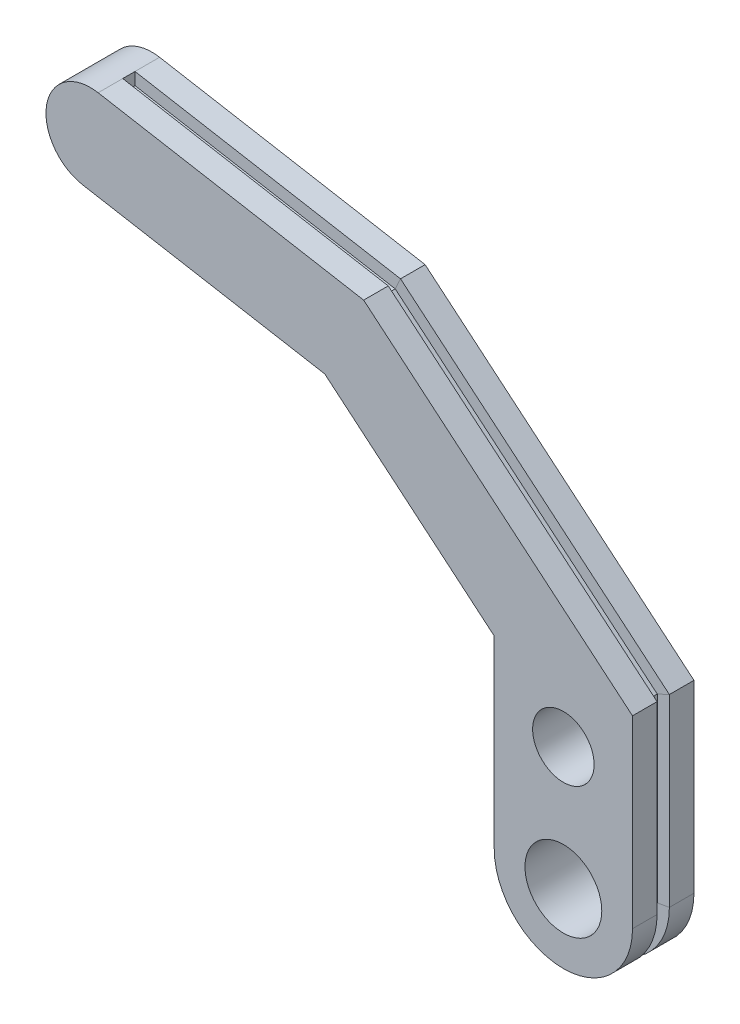
ISO-10303-21;
HEADER;
FILE_DESCRIPTION(('STEP AP214'),'2;1');
FILE_NAME('part.step','',(''),(''),'','','');
FILE_SCHEMA(('AUTOMOTIVE_DESIGN { 1 0 10303 214 1 1 1 1 }'));
ENDSEC;
DATA;
#1=APPLICATION_CONTEXT('core data for automotive mechanical design processes');
#2=APPLICATION_PROTOCOL_DEFINITION('international standard','automotive_design',2000,#1);
#3=PRODUCT_CONTEXT('',#1,'mechanical');
#4=PRODUCT('Part','Part','',(#3));
#5=PRODUCT_RELATED_PRODUCT_CATEGORY('part','',(#4));
#6=PRODUCT_DEFINITION_FORMATION('','',#4);
#7=PRODUCT_DEFINITION_CONTEXT('part definition',#1,'design');
#8=PRODUCT_DEFINITION('design','',#6,#7);
#9=PRODUCT_DEFINITION_SHAPE('','',#8);
#10=(LENGTH_UNIT() NAMED_UNIT(*) SI_UNIT(.MILLI.,.METRE.));
#11=(NAMED_UNIT(*) PLANE_ANGLE_UNIT() SI_UNIT($,.RADIAN.));
#12=(NAMED_UNIT(*) SI_UNIT($,.STERADIAN.) SOLID_ANGLE_UNIT());
#13=UNCERTAINTY_MEASURE_WITH_UNIT(LENGTH_MEASURE(1.E-05),#10,'distance_accuracy_value','');
#14=(GEOMETRIC_REPRESENTATION_CONTEXT(3) GLOBAL_UNCERTAINTY_ASSIGNED_CONTEXT((#13)) GLOBAL_UNIT_ASSIGNED_CONTEXT((#10,
#11,#12)) REPRESENTATION_CONTEXT('',''));
#15=CARTESIAN_POINT('',(0.,0.,0.));
#16=DIRECTION('',(0.,0.,1.));
#17=DIRECTION('',(1.,0.,0.));
#18=AXIS2_PLACEMENT_3D('',#15,#16,#17);
#19=CARTESIAN_POINT('',(0.,0.,6.35));
#20=DIRECTION('',(0.,0.,-1.));
#21=DIRECTION('',(-1.,0.,0.));
#22=AXIS2_PLACEMENT_3D('',#19,#20,#21);
#23=CYLINDRICAL_SURFACE('',#22,7.14375);
#24=CARTESIAN_POINT('',(0.,0.,3.81));
#25=DIRECTION('',(0.,0.,1.));
#26=DIRECTION('',(-1.,0.,0.));
#27=AXIS2_PLACEMENT_3D('',#24,#25,#26);
#28=CIRCLE('',#27,7.14375);
#29=CARTESIAN_POINT('',(-7.14375,0.,3.81));
#30=VERTEX_POINT('',#29);
#31=CARTESIAN_POINT('',(7.14375,0.,3.81));
#32=VERTEX_POINT('',#31);
#33=EDGE_CURVE('E56',#30,#32,#28,.T.);
#34=ORIENTED_EDGE('',*,*,#33,.T.);
#35=DIRECTION('',(0.,0.,-1.));
#36=VECTOR('',#35,1.);
#37=CARTESIAN_POINT('',(7.14375,0.,6.35));
#38=LINE('',#37,#36);
#39=CARTESIAN_POINT('',(7.14375,0.,6.35));
#40=VERTEX_POINT('',#39);
#41=EDGE_CURVE('E11',#40,#32,#38,.T.);
#42=ORIENTED_EDGE('',*,*,#41,.F.);
#43=CARTESIAN_POINT('',(0.,0.,6.35));
#44=DIRECTION('',(0.,0.,1.));
#45=DIRECTION('',(-1.,0.,0.));
#46=AXIS2_PLACEMENT_3D('',#43,#44,#45);
#47=CIRCLE('',#46,7.14375);
#48=CARTESIAN_POINT('',(-7.14375,0.,6.35));
#49=VERTEX_POINT('',#48);
#50=EDGE_CURVE('E183',#49,#40,#47,.T.);
#51=ORIENTED_EDGE('',*,*,#50,.F.);
#52=DIRECTION('',(0.,0.,-1.));
#53=VECTOR('',#52,1.);
#54=CARTESIAN_POINT('',(-7.14375,0.,6.35));
#55=LINE('',#54,#53);
#56=EDGE_CURVE('E184',#49,#30,#55,.T.);
#57=ORIENTED_EDGE('',*,*,#56,.T.);
#58=EDGE_LOOP('',(#34,#42,#51,#57));
#59=FACE_BOUND('',#58,.T.);
#60=ADVANCED_FACE('F41',(#59),#23,.T.);
#61=CARTESIAN_POINT('',(0.,0.,2.54));
#62=DIRECTION('',(0.,0.,1.));
#63=DIRECTION('',(-1.,0.,0.));
#64=AXIS2_PLACEMENT_3D('',#61,#62,#63);
#65=CIRCLE('',#64,7.14375);
#66=CARTESIAN_POINT('',(-7.14375,0.,2.54));
#67=VERTEX_POINT('',#66);
#68=CARTESIAN_POINT('',(7.14375,0.,2.54));
#69=VERTEX_POINT('',#68);
#70=EDGE_CURVE('E347',#67,#69,#65,.T.);
#71=ORIENTED_EDGE('',*,*,#70,.F.);
#72=CARTESIAN_POINT('',(-7.14375,0.,0.));
#73=VERTEX_POINT('',#72);
#74=EDGE_CURVE('E99',#67,#73,#55,.T.);
#75=ORIENTED_EDGE('',*,*,#74,.T.);
#76=CARTESIAN_POINT('',(0.,0.,0.));
#77=DIRECTION('',(0.,0.,1.));
#78=DIRECTION('',(-1.,0.,0.));
#79=AXIS2_PLACEMENT_3D('',#76,#77,#78);
#80=CIRCLE('',#79,7.14375);
#81=CARTESIAN_POINT('',(7.14375,0.,0.));
#82=VERTEX_POINT('',#81);
#83=EDGE_CURVE('E156',#73,#82,#80,.T.);
#84=ORIENTED_EDGE('',*,*,#83,.T.);
#85=EDGE_CURVE('E49',#69,#82,#38,.T.);
#86=ORIENTED_EDGE('',*,*,#85,.F.);
#87=EDGE_LOOP('',(#71,#75,#84,#86));
#88=FACE_BOUND('',#87,.T.);
#89=ADVANCED_FACE('F484',(#88),#23,.T.);
#90=CARTESIAN_POINT('',(7.14375,19.05,6.35));
#91=DIRECTION('',(-1.,0.,0.));
#92=DIRECTION('',(0.,-1.,0.));
#93=AXIS2_PLACEMENT_3D('',#90,#91,#92);
#94=PLANE('',#93);
#95=DIRECTION('',(0.,1.,0.));
#96=VECTOR('',#95,1.);
#97=CARTESIAN_POINT('',(7.14375,0.,3.81));
#98=LINE('',#97,#96);
#99=CARTESIAN_POINT('',(7.14375,19.05,3.81));
#100=VERTEX_POINT('',#99);
#101=EDGE_CURVE('E351',#32,#100,#98,.T.);
#102=ORIENTED_EDGE('',*,*,#101,.T.);
#103=DIRECTION('',(0.,0.,-1.));
#104=VECTOR('',#103,1.);
#105=CARTESIAN_POINT('',(7.14375,19.05,6.35));
#106=LINE('',#105,#104);
#107=CARTESIAN_POINT('',(7.14375,19.05,6.35));
#108=VERTEX_POINT('',#107);
#109=EDGE_CURVE('E202',#108,#100,#106,.T.);
#110=ORIENTED_EDGE('',*,*,#109,.F.);
#111=DIRECTION('',(0.,1.,0.));
#112=VECTOR('',#111,1.);
#113=CARTESIAN_POINT('',(7.14375,19.05,6.35));
#114=LINE('',#113,#112);
#115=EDGE_CURVE('E107',#40,#108,#114,.T.);
#116=ORIENTED_EDGE('',*,*,#115,.F.);
#117=ORIENTED_EDGE('',*,*,#41,.T.);
#118=EDGE_LOOP('',(#102,#110,#116,#117));
#119=FACE_BOUND('',#118,.T.);
#120=ADVANCED_FACE('F439',(#119),#94,.F.);
#121=DIRECTION('',(0.,1.,0.));
#122=VECTOR('',#121,1.);
#123=CARTESIAN_POINT('',(7.14375,0.,2.54));
#124=LINE('',#123,#122);
#125=CARTESIAN_POINT('',(7.14375,19.05,2.54));
#126=VERTEX_POINT('',#125);
#127=EDGE_CURVE('E363',#69,#126,#124,.T.);
#128=ORIENTED_EDGE('',*,*,#127,.F.);
#129=ORIENTED_EDGE('',*,*,#85,.T.);
#130=DIRECTION('',(0.,1.,0.));
#131=VECTOR('',#130,1.);
#132=CARTESIAN_POINT('',(7.14375,19.05,0.));
#133=LINE('',#132,#131);
#134=CARTESIAN_POINT('',(7.14375,19.05,0.));
#135=VERTEX_POINT('',#134);
#136=EDGE_CURVE('E159',#82,#135,#133,.T.);
#137=ORIENTED_EDGE('',*,*,#136,.T.);
#138=EDGE_CURVE('E201',#126,#135,#106,.T.);
#139=ORIENTED_EDGE('',*,*,#138,.F.);
#140=EDGE_LOOP('',(#128,#129,#137,#139));
#141=FACE_BOUND('',#140,.T.);
#142=ADVANCED_FACE('F224',(#141),#94,.F.);
#143=CARTESIAN_POINT('',(7.14375,19.05,6.35));
#144=DIRECTION('',(-0.642787609686537,-0.76604444311898,0.));
#145=DIRECTION('',(0.76604444311898,-0.642787609686537,0.));
#146=AXIS2_PLACEMENT_3D('',#143,#144,#145);
#147=PLANE('',#146);
#148=DIRECTION('',(-0.76604444311898,0.642787609686537,0.));
#149=VECTOR('',#148,1.);
#150=CARTESIAN_POINT('',(7.14375000000001,19.05,3.81));
#151=LINE('',#150,#149);
#152=CARTESIAN_POINT('',(-20.6373567597995,42.3611164358442,3.81));
#153=VERTEX_POINT('',#152);
#154=EDGE_CURVE('E387',#100,#153,#151,.T.);
#155=ORIENTED_EDGE('',*,*,#154,.T.);
#156=DIRECTION('',(0.,0.,-1.));
#157=VECTOR('',#156,1.);
#158=CARTESIAN_POINT('',(-20.6373567597995,42.3611164358442,6.35));
#159=LINE('',#158,#157);
#160=CARTESIAN_POINT('',(-20.6373567597995,42.3611164358442,6.35));
#161=VERTEX_POINT('',#160);
#162=EDGE_CURVE('E198',#161,#153,#159,.T.);
#163=ORIENTED_EDGE('',*,*,#162,.F.);
#164=DIRECTION('',(-0.76604444311898,0.642787609686537,0.));
#165=VECTOR('',#164,1.);
#166=CARTESIAN_POINT('',(7.14375,19.05,6.35));
#167=LINE('',#166,#165);
#168=EDGE_CURVE('E305',#108,#161,#167,.T.);
#169=ORIENTED_EDGE('',*,*,#168,.F.);
#170=ORIENTED_EDGE('',*,*,#109,.T.);
#171=EDGE_LOOP('',(#155,#163,#169,#170));
#172=FACE_BOUND('',#171,.T.);
#173=ADVANCED_FACE('F468',(#172),#147,.F.);
#174=DIRECTION('',(-0.76604444311898,0.642787609686537,0.));
#175=VECTOR('',#174,1.);
#176=CARTESIAN_POINT('',(7.14375000000001,19.05,2.54));
#177=LINE('',#176,#175);
#178=CARTESIAN_POINT('',(-20.6373567597995,42.3611164358442,2.54));
#179=VERTEX_POINT('',#178);
#180=EDGE_CURVE('E220',#126,#179,#177,.T.);
#181=ORIENTED_EDGE('',*,*,#180,.F.);
#182=ORIENTED_EDGE('',*,*,#138,.T.);
#183=DIRECTION('',(-0.76604444311898,0.642787609686537,0.));
#184=VECTOR('',#183,1.);
#185=CARTESIAN_POINT('',(7.14375,19.05,0.));
#186=LINE('',#185,#184);
#187=CARTESIAN_POINT('',(-20.6373567597995,42.3611164358442,0.));
#188=VERTEX_POINT('',#187);
#189=EDGE_CURVE('E164',#135,#188,#186,.T.);
#190=ORIENTED_EDGE('',*,*,#189,.T.);
#191=EDGE_CURVE('E197',#179,#188,#159,.T.);
#192=ORIENTED_EDGE('',*,*,#191,.F.);
#193=EDGE_LOOP('',(#181,#182,#190,#192));
#194=FACE_BOUND('',#193,.T.);
#195=ADVANCED_FACE('F214',(#194),#147,.F.);
#196=CARTESIAN_POINT('',(-20.6373567597995,42.3611164358442,6.35));
#197=DIRECTION('',(-0.173648177666924,-0.984807753012209,0.));
#198=DIRECTION('',(0.984807753012209,-0.173648177666924,0.));
#199=AXIS2_PLACEMENT_3D('',#196,#197,#198);
#200=PLANE('',#199);
#201=DIRECTION('',(-0.984807753012209,0.173648177666924,0.));
#202=VECTOR('',#201,1.);
#203=CARTESIAN_POINT('',(-20.6373567597995,42.3611164358442,3.81));
#204=LINE('',#203,#202);
#205=CARTESIAN_POINT('',(-48.0748879046232,47.1990934607053,3.81));
#206=VERTEX_POINT('',#205);
#207=EDGE_CURVE('E271',#153,#206,#204,.T.);
#208=ORIENTED_EDGE('',*,*,#207,.T.);
#209=DIRECTION('',(0.,0.,-1.));
#210=VECTOR('',#209,1.);
#211=CARTESIAN_POINT('',(-48.0748879046232,47.1990934607053,6.35));
#212=LINE('',#211,#210);
#213=CARTESIAN_POINT('',(-48.0748879046232,47.1990934607053,6.35));
#214=VERTEX_POINT('',#213);
#215=EDGE_CURVE('E193',#214,#206,#212,.T.);
#216=ORIENTED_EDGE('',*,*,#215,.F.);
#217=DIRECTION('',(-0.984807753012209,0.173648177666924,0.));
#218=VECTOR('',#217,1.);
#219=CARTESIAN_POINT('',(-20.6373567597995,42.3611164358442,6.35));
#220=LINE('',#219,#218);
#221=EDGE_CURVE('E308',#161,#214,#220,.T.);
#222=ORIENTED_EDGE('',*,*,#221,.F.);
#223=ORIENTED_EDGE('',*,*,#162,.T.);
#224=EDGE_LOOP('',(#208,#216,#222,#223));
#225=FACE_BOUND('',#224,.T.);
#226=ADVANCED_FACE('F471',(#225),#200,.F.);
#227=DIRECTION('',(-0.984807753012209,0.173648177666924,0.));
#228=VECTOR('',#227,1.);
#229=CARTESIAN_POINT('',(-20.6373567597995,42.3611164358442,2.54));
#230=LINE('',#229,#228);
#231=CARTESIAN_POINT('',(-48.0748879046232,47.1990934607053,2.54));
#232=VERTEX_POINT('',#231);
#233=EDGE_CURVE('E239',#179,#232,#230,.T.);
#234=ORIENTED_EDGE('',*,*,#233,.F.);
#235=ORIENTED_EDGE('',*,*,#191,.T.);
#236=DIRECTION('',(-0.984807753012209,0.173648177666924,0.));
#237=VECTOR('',#236,1.);
#238=CARTESIAN_POINT('',(-20.6373567597995,42.3611164358442,0.));
#239=LINE('',#238,#237);
#240=CARTESIAN_POINT('',(-48.0748879046232,47.1990934607053,0.));
#241=VERTEX_POINT('',#240);
#242=EDGE_CURVE('E168',#188,#241,#239,.T.);
#243=ORIENTED_EDGE('',*,*,#242,.T.);
#244=EDGE_CURVE('E192',#232,#241,#212,.T.);
#245=ORIENTED_EDGE('',*,*,#244,.F.);
#246=EDGE_LOOP('',(#234,#235,#243,#245));
#247=FACE_BOUND('',#246,.T.);
#248=ADVANCED_FACE('F234',(#247),#200,.F.);
#249=CARTESIAN_POINT('',(0.,0.,6.35));
#250=DIRECTION('',(0.,0.,-1.));
#251=DIRECTION('',(-1.,0.,0.));
#252=AXIS2_PLACEMENT_3D('',#249,#250,#251);
#253=PLANE('',#252);
#254=ORIENTED_EDGE('',*,*,#50,.T.);
#255=ORIENTED_EDGE('',*,*,#115,.T.);
#256=ORIENTED_EDGE('',*,*,#168,.T.);
#257=ORIENTED_EDGE('',*,*,#221,.T.);
#258=CARTESIAN_POINT('',(-48.8722654004166,42.6769409654397,6.35));
#259=DIRECTION('',(0.,0.,1.));
#260=DIRECTION('',(1.,0.,0.));
#261=AXIS2_PLACEMENT_3D('',#258,#259,#260);
#262=CIRCLE('',#261,4.5919139866982);
#263=CARTESIAN_POINT('',(-49.66964289621,38.1547884701741,6.35));
#264=VERTEX_POINT('',#263);
#265=EDGE_CURVE('E131',#214,#264,#262,.T.);
#266=ORIENTED_EDGE('',*,*,#265,.T.);
#267=DIRECTION('',(0.984807753012209,-0.173648177666924,0.));
#268=VECTOR('',#267,1.);
#269=CARTESIAN_POINT('',(-24.6555259696999,33.7441247574342,6.35));
#270=LINE('',#269,#268);
#271=CARTESIAN_POINT('',(-24.6555259696999,33.7441247574342,6.35));
#272=VERTEX_POINT('',#271);
#273=EDGE_CURVE('E123',#264,#272,#270,.T.);
#274=ORIENTED_EDGE('',*,*,#273,.T.);
#275=DIRECTION('',(0.76604444311898,-0.642787609686537,0.));
#276=VECTOR('',#275,1.);
#277=CARTESIAN_POINT('',(-7.14375,19.05,6.35));
#278=LINE('',#277,#276);
#279=CARTESIAN_POINT('',(-7.14375,19.05,6.35));
#280=VERTEX_POINT('',#279);
#281=EDGE_CURVE('E128',#272,#280,#278,.T.);
#282=ORIENTED_EDGE('',*,*,#281,.T.);
#283=DIRECTION('',(0.,-1.,0.));
#284=VECTOR('',#283,1.);
#285=CARTESIAN_POINT('',(-7.14375,0.,6.35));
#286=LINE('',#285,#284);
#287=EDGE_CURVE('E65',#280,#49,#286,.T.);
#288=ORIENTED_EDGE('',*,*,#287,.T.);
#289=EDGE_LOOP('',(#254,#255,#256,#257,#266,#274,#282,#288));
#290=FACE_BOUND('',#289,.T.);
#291=CARTESIAN_POINT('',(0.,0.,6.35));
#292=DIRECTION('',(0.,0.,1.));
#293=DIRECTION('',(1.,0.,0.));
#294=AXIS2_PLACEMENT_3D('',#291,#292,#293);
#295=CIRCLE('',#294,3.96875);
#296=CARTESIAN_POINT('',(3.96875,0.,6.35));
#297=VERTEX_POINT('',#296);
#298=EDGE_CURVE('E160',#297,#297,#295,.T.);
#299=ORIENTED_EDGE('',*,*,#298,.F.);
#300=EDGE_LOOP('',(#299));
#301=FACE_BOUND('',#300,.T.);
#302=CARTESIAN_POINT('',(0.,12.7,6.35));
#303=DIRECTION('',(0.,0.,1.));
#304=DIRECTION('',(1.,0.,0.));
#305=AXIS2_PLACEMENT_3D('',#302,#303,#304);
#306=CIRCLE('',#305,3.175);
#307=CARTESIAN_POINT('',(3.175,12.7,6.35));
#308=VERTEX_POINT('',#307);
#309=EDGE_CURVE('E285',#308,#308,#306,.T.);
#310=ORIENTED_EDGE('',*,*,#309,.F.);
#311=EDGE_LOOP('',(#310));
#312=FACE_BOUND('',#311,.T.);
#313=ADVANCED_FACE('F125',(#290,#301,#312),#253,.F.);
#314=CARTESIAN_POINT('',(0.,0.,0.));
#315=DIRECTION('',(0.,0.,-1.));
#316=DIRECTION('',(-1.,0.,0.));
#317=AXIS2_PLACEMENT_3D('',#314,#315,#316);
#318=PLANE('',#317);
#319=CARTESIAN_POINT('',(0.,0.,0.));
#320=DIRECTION('',(0.,0.,1.));
#321=DIRECTION('',(1.,0.,0.));
#322=AXIS2_PLACEMENT_3D('',#319,#320,#321);
#323=CIRCLE('',#322,3.96875);
#324=CARTESIAN_POINT('',(3.96875,0.,0.));
#325=VERTEX_POINT('',#324);
#326=EDGE_CURVE('E289',#325,#325,#323,.T.);
#327=ORIENTED_EDGE('',*,*,#326,.T.);
#328=EDGE_LOOP('',(#327));
#329=FACE_BOUND('',#328,.T.);
#330=ORIENTED_EDGE('',*,*,#83,.F.);
#331=DIRECTION('',(0.,-1.,0.));
#332=VECTOR('',#331,1.);
#333=CARTESIAN_POINT('',(-7.14375,0.,0.));
#334=LINE('',#333,#332);
#335=CARTESIAN_POINT('',(-7.14375,19.05,0.));
#336=VERTEX_POINT('',#335);
#337=EDGE_CURVE('E180',#336,#73,#334,.T.);
#338=ORIENTED_EDGE('',*,*,#337,.F.);
#339=DIRECTION('',(0.76604444311898,-0.642787609686537,0.));
#340=VECTOR('',#339,1.);
#341=CARTESIAN_POINT('',(-7.14375,19.05,0.));
#342=LINE('',#341,#340);
#343=CARTESIAN_POINT('',(-24.6555259696999,33.7441247574342,0.));
#344=VERTEX_POINT('',#343);
#345=EDGE_CURVE('E177',#344,#336,#342,.T.);
#346=ORIENTED_EDGE('',*,*,#345,.F.);
#347=DIRECTION('',(0.984807753012209,-0.173648177666924,0.));
#348=VECTOR('',#347,1.);
#349=CARTESIAN_POINT('',(-24.6555259696999,33.7441247574342,0.));
#350=LINE('',#349,#348);
#351=CARTESIAN_POINT('',(-49.66964289621,38.1547884701741,0.));
#352=VERTEX_POINT('',#351);
#353=EDGE_CURVE('E141',#352,#344,#350,.T.);
#354=ORIENTED_EDGE('',*,*,#353,.F.);
#355=CARTESIAN_POINT('',(-48.8722654004166,42.6769409654397,0.));
#356=DIRECTION('',(0.,0.,1.));
#357=DIRECTION('',(1.,0.,0.));
#358=AXIS2_PLACEMENT_3D('',#355,#356,#357);
#359=CIRCLE('',#358,4.5919139866982);
#360=EDGE_CURVE('E172',#241,#352,#359,.T.);
#361=ORIENTED_EDGE('',*,*,#360,.F.);
#362=ORIENTED_EDGE('',*,*,#242,.F.);
#363=ORIENTED_EDGE('',*,*,#189,.F.);
#364=ORIENTED_EDGE('',*,*,#136,.F.);
#365=EDGE_LOOP('',(#330,#338,#346,#354,#361,#362,#363,#364));
#366=FACE_BOUND('',#365,.T.);
#367=CARTESIAN_POINT('',(0.,12.7,0.));
#368=DIRECTION('',(0.,0.,1.));
#369=DIRECTION('',(1.,0.,0.));
#370=AXIS2_PLACEMENT_3D('',#367,#368,#369);
#371=CIRCLE('',#370,3.175);
#372=CARTESIAN_POINT('',(3.175,12.7,0.));
#373=VERTEX_POINT('',#372);
#374=EDGE_CURVE('E290',#373,#373,#371,.T.);
#375=ORIENTED_EDGE('',*,*,#374,.T.);
#376=EDGE_LOOP('',(#375));
#377=FACE_BOUND('',#376,.T.);
#378=ADVANCED_FACE('F228',(#329,#366,#377),#318,.T.);
#379=CARTESIAN_POINT('',(-48.8722654004166,42.6769409654397,6.35));
#380=DIRECTION('',(0.,0.,-1.));
#381=DIRECTION('',(-1.,0.,0.));
#382=AXIS2_PLACEMENT_3D('',#379,#380,#381);
#383=CYLINDRICAL_SURFACE('',#382,4.5919139866982);
#384=ORIENTED_EDGE('',*,*,#360,.T.);
#385=DIRECTION('',(0.,0.,-1.));
#386=VECTOR('',#385,1.);
#387=CARTESIAN_POINT('',(-49.66964289621,38.1547884701741,6.35));
#388=LINE('',#387,#386);
#389=EDGE_CURVE('E145',#264,#352,#388,.T.);
#390=ORIENTED_EDGE('',*,*,#389,.F.);
#391=ORIENTED_EDGE('',*,*,#265,.F.);
#392=ORIENTED_EDGE('',*,*,#215,.T.);
#393=DIRECTION('',(0.,0.,1.));
#394=VECTOR('',#393,1.);
#395=CARTESIAN_POINT('',(-48.0748879046232,47.1990934607053,3.81));
#396=LINE('',#395,#394);
#397=EDGE_CURVE('E246',#232,#206,#396,.T.);
#398=ORIENTED_EDGE('',*,*,#397,.F.);
#399=ORIENTED_EDGE('',*,*,#244,.T.);
#400=EDGE_LOOP('',(#384,#390,#391,#392,#398,#399));
#401=FACE_BOUND('',#400,.T.);
#402=ADVANCED_FACE('F244',(#401),#383,.T.);
#403=CARTESIAN_POINT('',(-24.6555259696999,33.7441247574342,6.35));
#404=DIRECTION('',(0.173648177666924,0.984807753012209,0.));
#405=DIRECTION('',(-0.984807753012209,0.173648177666924,0.));
#406=AXIS2_PLACEMENT_3D('',#403,#404,#405);
#407=PLANE('',#406);
#408=ORIENTED_EDGE('',*,*,#353,.T.);
#409=DIRECTION('',(0.,0.,-1.));
#410=VECTOR('',#409,1.);
#411=CARTESIAN_POINT('',(-24.6555259696999,33.7441247574342,6.35));
#412=LINE('',#411,#410);
#413=EDGE_CURVE('E138',#272,#344,#412,.T.);
#414=ORIENTED_EDGE('',*,*,#413,.F.);
#415=ORIENTED_EDGE('',*,*,#273,.F.);
#416=ORIENTED_EDGE('',*,*,#389,.T.);
#417=EDGE_LOOP('',(#408,#414,#415,#416));
#418=FACE_BOUND('',#417,.T.);
#419=ADVANCED_FACE('F139',(#418),#407,.F.);
#420=CARTESIAN_POINT('',(-7.14375,19.05,6.35));
#421=DIRECTION('',(0.642787609686537,0.76604444311898,0.));
#422=DIRECTION('',(-0.76604444311898,0.642787609686537,0.));
#423=AXIS2_PLACEMENT_3D('',#420,#421,#422);
#424=PLANE('',#423);
#425=ORIENTED_EDGE('',*,*,#345,.T.);
#426=DIRECTION('',(0.,0.,-1.));
#427=VECTOR('',#426,1.);
#428=CARTESIAN_POINT('',(-7.14375,19.05,6.35));
#429=LINE('',#428,#427);
#430=EDGE_CURVE('E146',#280,#336,#429,.T.);
#431=ORIENTED_EDGE('',*,*,#430,.F.);
#432=ORIENTED_EDGE('',*,*,#281,.F.);
#433=ORIENTED_EDGE('',*,*,#413,.T.);
#434=EDGE_LOOP('',(#425,#431,#432,#433));
#435=FACE_BOUND('',#434,.T.);
#436=ADVANCED_FACE('F148',(#435),#424,.F.);
#437=CARTESIAN_POINT('',(-7.14375,0.,6.35));
#438=DIRECTION('',(1.,0.,0.));
#439=DIRECTION('',(0.,0.,-1.));
#440=AXIS2_PLACEMENT_3D('',#437,#438,#439);
#441=PLANE('',#440);
#442=ORIENTED_EDGE('',*,*,#337,.T.);
#443=ORIENTED_EDGE('',*,*,#74,.F.);
#444=DIRECTION('',(0.,0.,1.));
#445=VECTOR('',#444,1.);
#446=CARTESIAN_POINT('',(-7.14375,0.,3.81));
#447=LINE('',#446,#445);
#448=EDGE_CURVE('E321',#67,#30,#447,.T.);
#449=ORIENTED_EDGE('',*,*,#448,.T.);
#450=ORIENTED_EDGE('',*,*,#56,.F.);
#451=ORIENTED_EDGE('',*,*,#287,.F.);
#452=ORIENTED_EDGE('',*,*,#430,.T.);
#453=EDGE_LOOP('',(#442,#443,#449,#450,#451,#452));
#454=FACE_BOUND('',#453,.T.);
#455=ADVANCED_FACE('F474',(#454),#441,.F.);
#456=CARTESIAN_POINT('',(0.,0.,6.35));
#457=DIRECTION('',(0.,0.,-1.));
#458=DIRECTION('',(-1.,0.,0.));
#459=AXIS2_PLACEMENT_3D('',#456,#457,#458);
#460=CYLINDRICAL_SURFACE('',#459,3.96875);
#461=ORIENTED_EDGE('',*,*,#298,.T.);
#462=EDGE_LOOP('',(#461));
#463=FACE_BOUND('',#462,.T.);
#464=ORIENTED_EDGE('',*,*,#326,.F.);
#465=EDGE_LOOP('',(#464));
#466=FACE_BOUND('',#465,.T.);
#467=ADVANCED_FACE('F568',(#463,#466),#460,.F.);
#468=CARTESIAN_POINT('',(0.,12.7,6.35));
#469=DIRECTION('',(0.,0.,-1.));
#470=DIRECTION('',(-1.,0.,0.));
#471=AXIS2_PLACEMENT_3D('',#468,#469,#470);
#472=CYLINDRICAL_SURFACE('',#471,3.175);
#473=ORIENTED_EDGE('',*,*,#309,.T.);
#474=EDGE_LOOP('',(#473));
#475=FACE_BOUND('',#474,.T.);
#476=ORIENTED_EDGE('',*,*,#374,.F.);
#477=EDGE_LOOP('',(#476));
#478=FACE_BOUND('',#477,.T.);
#479=ADVANCED_FACE('F499',(#475,#478),#472,.F.);
#480=CARTESIAN_POINT('',(-48.0748879046232,0.,0.));
#481=DIRECTION('',(1.,0.,0.));
#482=DIRECTION('',(0.,0.,-1.));
#483=AXIS2_PLACEMENT_3D('',#480,#481,#482);
#484=PLANE('',#483);
#485=DIRECTION('',(0.,-1.,0.));
#486=VECTOR('',#485,1.);
#487=CARTESIAN_POINT('',(-48.0748879046232,47.1990934607053,3.81));
#488=LINE('',#487,#486);
#489=CARTESIAN_POINT('',(-48.0748879046232,45.9290934607053,3.81));
#490=VERTEX_POINT('',#489);
#491=EDGE_CURVE('E276',#206,#490,#488,.T.);
#492=ORIENTED_EDGE('',*,*,#491,.T.);
#493=DIRECTION('',(0.,0.,-1.));
#494=VECTOR('',#493,1.);
#495=CARTESIAN_POINT('',(-48.0748879046232,45.9290934607053,3.81));
#496=LINE('',#495,#494);
#497=CARTESIAN_POINT('',(-48.0748879046232,45.9290934607053,2.54));
#498=VERTEX_POINT('',#497);
#499=EDGE_CURVE('E266',#490,#498,#496,.T.);
#500=ORIENTED_EDGE('',*,*,#499,.T.);
#501=DIRECTION('',(0.,1.,0.));
#502=VECTOR('',#501,1.);
#503=CARTESIAN_POINT('',(-48.0748879046232,47.1990934607053,2.54));
#504=LINE('',#503,#502);
#505=EDGE_CURVE('E257',#498,#232,#504,.T.);
#506=ORIENTED_EDGE('',*,*,#505,.T.);
#507=ORIENTED_EDGE('',*,*,#397,.T.);
#508=EDGE_LOOP('',(#492,#500,#506,#507));
#509=FACE_BOUND('',#508,.T.);
#510=ADVANCED_FACE('F459',(#509),#484,.T.);
#511=CARTESIAN_POINT('',(39.3382831752504,8.19603656698233,0.));
#512=DIRECTION('',(-0.173648177666924,0.984807753012209,0.));
#513=DIRECTION('',(0.,0.,-1.));
#514=AXIS2_PLACEMENT_3D('',#511,#512,#513);
#515=PLANE('',#514);
#516=DIRECTION('',(0.984807753012209,0.173648177666924,0.));
#517=VECTOR('',#516,1.);
#518=CARTESIAN_POINT('',(-7.14375,0.,3.81));
#519=LINE('',#518,#517);
#520=CARTESIAN_POINT('',(-5.89304415367449,0.220533185637008,3.81));
#521=VERTEX_POINT('',#520);
#522=EDGE_CURVE('E294',#30,#521,#519,.T.);
#523=ORIENTED_EDGE('',*,*,#522,.F.);
#524=ORIENTED_EDGE('',*,*,#448,.F.);
#525=DIRECTION('',(-0.984807753012209,-0.173648177666924,0.));
#526=VECTOR('',#525,1.);
#527=CARTESIAN_POINT('',(-7.14375,0.,2.54));
#528=LINE('',#527,#526);
#529=CARTESIAN_POINT('',(-5.89304415367449,0.220533185637008,2.54));
#530=VERTEX_POINT('',#529);
#531=EDGE_CURVE('E317',#530,#67,#528,.T.);
#532=ORIENTED_EDGE('',*,*,#531,.F.);
#533=DIRECTION('',(0.,0.,-1.));
#534=VECTOR('',#533,1.);
#535=CARTESIAN_POINT('',(-5.89304415367449,0.220533185637008,3.81));
#536=LINE('',#535,#534);
#537=EDGE_CURVE('E313',#521,#530,#536,.T.);
#538=ORIENTED_EDGE('',*,*,#537,.F.);
#539=EDGE_LOOP('',(#523,#524,#532,#538));
#540=FACE_BOUND('',#539,.T.);
#541=ADVANCED_FACE('F478',(#540),#515,.F.);
#542=CARTESIAN_POINT('',(-20.6373567597995,42.3611164358442,3.81));
#543=DIRECTION('',(0.,0.,-1.));
#544=DIRECTION('',(-1.,0.,0.));
#545=AXIS2_PLACEMENT_3D('',#542,#543,#544);
#546=PLANE('',#545);
#547=DIRECTION('',(0.422618261740695,0.906307787036652,0.));
#548=VECTOR('',#547,1.);
#549=CARTESIAN_POINT('',(-24.6041545884778,33.8542910399812,3.81));
#550=LINE('',#549,#548);
#551=CARTESIAN_POINT('',(-21.1845738610894,41.1876055751067,3.81));
#552=VERTEX_POINT('',#551);
#553=EDGE_CURVE('E389',#552,#153,#550,.T.);
#554=ORIENTED_EDGE('',*,*,#553,.F.);
#555=DIRECTION('',(-0.984807753012209,0.173648177666924,0.));
#556=VECTOR('',#555,1.);
#557=CARTESIAN_POINT('',(-20.6373567597995,41.0911164358442,3.81));
#558=LINE('',#557,#556);
#559=EDGE_CURVE('E270',#552,#490,#558,.T.);
#560=ORIENTED_EDGE('',*,*,#559,.T.);
#561=ORIENTED_EDGE('',*,*,#491,.F.);
#562=ORIENTED_EDGE('',*,*,#207,.F.);
#563=EDGE_LOOP('',(#554,#560,#561,#562));
#564=FACE_BOUND('',#563,.T.);
#565=ADVANCED_FACE('F465',(#564),#546,.T.);
#566=CARTESIAN_POINT('',(-20.6373567597995,41.0911164358442,3.81));
#567=DIRECTION('',(0.173648177666924,0.984807753012209,0.));
#568=DIRECTION('',(-0.984807753012209,0.173648177666924,0.));
#569=AXIS2_PLACEMENT_3D('',#566,#567,#568);
#570=PLANE('',#569);
#571=DIRECTION('',(0.,0.,1.));
#572=VECTOR('',#571,1.);
#573=CARTESIAN_POINT('',(-21.1845738610894,41.1876055751067,3.81));
#574=LINE('',#573,#572);
#575=CARTESIAN_POINT('',(-21.1845738610894,41.1876055751067,2.54));
#576=VERTEX_POINT('',#575);
#577=EDGE_CURVE('E393',#576,#552,#574,.T.);
#578=ORIENTED_EDGE('',*,*,#577,.F.);
#579=DIRECTION('',(-0.984807753012209,0.173648177666924,0.));
#580=VECTOR('',#579,1.);
#581=CARTESIAN_POINT('',(-20.6373567597995,41.0911164358442,2.54));
#582=LINE('',#581,#580);
#583=EDGE_CURVE('E265',#576,#498,#582,.T.);
#584=ORIENTED_EDGE('',*,*,#583,.T.);
#585=ORIENTED_EDGE('',*,*,#499,.F.);
#586=ORIENTED_EDGE('',*,*,#559,.F.);
#587=EDGE_LOOP('',(#578,#584,#585,#586));
#588=FACE_BOUND('',#587,.T.);
#589=ADVANCED_FACE('F464',(#588),#570,.T.);
#590=CARTESIAN_POINT('',(-20.6373567597995,42.3611164358442,2.54));
#591=DIRECTION('',(0.,0.,1.));
#592=DIRECTION('',(0.,-1.,0.));
#593=AXIS2_PLACEMENT_3D('',#590,#591,#592);
#594=PLANE('',#593);
#595=DIRECTION('',(-0.422618261740695,-0.906307787036652,0.));
#596=VECTOR('',#595,1.);
#597=CARTESIAN_POINT('',(-24.6041545884778,33.8542910399812,2.53999999999999));
#598=LINE('',#597,#596);
#599=EDGE_CURVE('E275',#179,#576,#598,.T.);
#600=ORIENTED_EDGE('',*,*,#599,.F.);
#601=ORIENTED_EDGE('',*,*,#233,.T.);
#602=ORIENTED_EDGE('',*,*,#505,.F.);
#603=ORIENTED_EDGE('',*,*,#583,.F.);
#604=EDGE_LOOP('',(#600,#601,#602,#603));
#605=FACE_BOUND('',#604,.T.);
#606=ADVANCED_FACE('F604',(#605),#594,.T.);
#607=CARTESIAN_POINT('',(7.14375000000001,19.05,3.81));
#608=DIRECTION('',(0.,0.,-1.));
#609=DIRECTION('',(-1.,0.,0.));
#610=AXIS2_PLACEMENT_3D('',#607,#608,#609);
#611=PLANE('',#610);
#612=DIRECTION('',(-0.76604444311898,0.642787609686537,0.));
#613=VECTOR('',#612,1.);
#614=CARTESIAN_POINT('',(6.50875000000001,17.9501477371938,3.81));
#615=LINE('',#614,#613);
#616=CARTESIAN_POINT('',(5.8930441536745,18.4667862857592,3.81));
#617=VERTEX_POINT('',#616);
#618=EDGE_CURVE('E384',#617,#552,#615,.T.);
#619=ORIENTED_EDGE('',*,*,#618,.T.);
#620=ORIENTED_EDGE('',*,*,#553,.T.);
#621=ORIENTED_EDGE('',*,*,#154,.F.);
#622=DIRECTION('',(0.906307787036649,0.422618261740701,0.));
#623=VECTOR('',#622,1.);
#624=CARTESIAN_POINT('',(-0.152823320708288,15.6475519822643,3.81));
#625=LINE('',#624,#623);
#626=EDGE_CURVE('E367',#617,#100,#625,.T.);
#627=ORIENTED_EDGE('',*,*,#626,.F.);
#628=EDGE_LOOP('',(#619,#620,#621,#627));
#629=FACE_BOUND('',#628,.T.);
#630=ADVANCED_FACE('F466',(#629),#611,.T.);
#631=CARTESIAN_POINT('',(6.50875000000001,17.9501477371938,3.81));
#632=DIRECTION('',(0.642787609686537,0.76604444311898,0.));
#633=DIRECTION('',(-0.76604444311898,0.642787609686537,0.));
#634=AXIS2_PLACEMENT_3D('',#631,#632,#633);
#635=PLANE('',#634);
#636=DIRECTION('',(-0.76604444311898,0.642787609686537,0.));
#637=VECTOR('',#636,1.);
#638=CARTESIAN_POINT('',(6.50875000000001,17.9501477371938,2.54));
#639=LINE('',#638,#637);
#640=CARTESIAN_POINT('',(5.8930441536745,18.4667862857592,2.54));
#641=VERTEX_POINT('',#640);
#642=EDGE_CURVE('E260',#641,#576,#639,.T.);
#643=ORIENTED_EDGE('',*,*,#642,.T.);
#644=ORIENTED_EDGE('',*,*,#577,.T.);
#645=ORIENTED_EDGE('',*,*,#618,.F.);
#646=DIRECTION('',(0.,0.,1.));
#647=VECTOR('',#646,1.);
#648=CARTESIAN_POINT('',(5.89304415367449,18.4667862857592,3.81));
#649=LINE('',#648,#647);
#650=EDGE_CURVE('E371',#641,#617,#649,.T.);
#651=ORIENTED_EDGE('',*,*,#650,.F.);
#652=EDGE_LOOP('',(#643,#644,#645,#651));
#653=FACE_BOUND('',#652,.T.);
#654=ADVANCED_FACE('F414',(#653),#635,.T.);
#655=CARTESIAN_POINT('',(7.14375000000001,19.05,2.54));
#656=DIRECTION('',(0.,0.,1.));
#657=DIRECTION('',(0.,-1.,0.));
#658=AXIS2_PLACEMENT_3D('',#655,#656,#657);
#659=PLANE('',#658);
#660=ORIENTED_EDGE('',*,*,#180,.T.);
#661=ORIENTED_EDGE('',*,*,#599,.T.);
#662=ORIENTED_EDGE('',*,*,#642,.F.);
#663=DIRECTION('',(-0.906307787036649,-0.422618261740701,0.));
#664=VECTOR('',#663,1.);
#665=CARTESIAN_POINT('',(-0.152823320708288,15.6475519822643,2.53999999999999));
#666=LINE('',#665,#664);
#667=EDGE_CURVE('E375',#126,#641,#666,.T.);
#668=ORIENTED_EDGE('',*,*,#667,.F.);
#669=EDGE_LOOP('',(#660,#661,#662,#668));
#670=FACE_BOUND('',#669,.T.);
#671=ADVANCED_FACE('F404',(#670),#659,.T.);
#672=CARTESIAN_POINT('',(-7.14375,0.,3.81));
#673=DIRECTION('',(0.,0.,-1.));
#674=DIRECTION('',(-1.,0.,0.));
#675=AXIS2_PLACEMENT_3D('',#672,#673,#674);
#676=PLANE('',#675);
#677=CARTESIAN_POINT('',(0.,0.,3.81));
#678=DIRECTION('',(0.,0.,1.));
#679=DIRECTION('',(-0.999300508160957,0.0373964488855906,0.));
#680=AXIS2_PLACEMENT_3D('',#677,#678,#679);
#681=CIRCLE('',#680,5.89716917538613);
#682=CARTESIAN_POINT('',(5.89304415367449,-0.220533185637008,3.81));
#683=VERTEX_POINT('',#682);
#684=EDGE_CURVE('E331',#521,#683,#681,.T.);
#685=ORIENTED_EDGE('',*,*,#684,.T.);
#686=DIRECTION('',(-0.984807753012209,-0.173648177666924,0.));
#687=VECTOR('',#686,1.);
#688=CARTESIAN_POINT('',(7.14375,0.,3.81));
#689=LINE('',#688,#687);
#690=EDGE_CURVE('E327',#32,#683,#689,.T.);
#691=ORIENTED_EDGE('',*,*,#690,.F.);
#692=ORIENTED_EDGE('',*,*,#33,.F.);
#693=ORIENTED_EDGE('',*,*,#522,.T.);
#694=EDGE_LOOP('',(#685,#691,#692,#693));
#695=FACE_BOUND('',#694,.T.);
#696=ADVANCED_FACE('F432',(#695),#676,.T.);
#697=CARTESIAN_POINT('',(0.,0.,0.));
#698=DIRECTION('',(0.,0.,1.));
#699=DIRECTION('',(1.,0.,0.));
#700=AXIS2_PLACEMENT_3D('',#697,#698,#699);
#701=CYLINDRICAL_SURFACE('',#700,5.89716917538613);
#702=CARTESIAN_POINT('',(0.,0.,2.54));
#703=DIRECTION('',(0.,0.,1.));
#704=DIRECTION('',(-0.999300508160957,0.0373964488855906,0.));
#705=AXIS2_PLACEMENT_3D('',#702,#703,#704);
#706=CIRCLE('',#705,5.89716917538613);
#707=CARTESIAN_POINT('',(5.89304415367449,-0.220533185637008,2.54));
#708=VERTEX_POINT('',#707);
#709=EDGE_CURVE('E339',#530,#708,#706,.T.);
#710=ORIENTED_EDGE('',*,*,#709,.T.);
#711=DIRECTION('',(0.,0.,-1.));
#712=VECTOR('',#711,1.);
#713=CARTESIAN_POINT('',(5.89304415367449,-0.220533185637008,3.81));
#714=LINE('',#713,#712);
#715=EDGE_CURVE('E335',#683,#708,#714,.T.);
#716=ORIENTED_EDGE('',*,*,#715,.F.);
#717=ORIENTED_EDGE('',*,*,#684,.F.);
#718=ORIENTED_EDGE('',*,*,#537,.T.);
#719=EDGE_LOOP('',(#710,#716,#717,#718));
#720=FACE_BOUND('',#719,.T.);
#721=ADVANCED_FACE('F645',(#720),#701,.T.);
#722=CARTESIAN_POINT('',(-7.14375,0.,2.54));
#723=DIRECTION('',(0.,0.,1.));
#724=DIRECTION('',(1.,0.,0.));
#725=AXIS2_PLACEMENT_3D('',#722,#723,#724);
#726=PLANE('',#725);
#727=ORIENTED_EDGE('',*,*,#70,.T.);
#728=DIRECTION('',(0.984807753012209,0.173648177666924,0.));
#729=VECTOR('',#728,1.);
#730=CARTESIAN_POINT('',(7.14375,0.,2.54));
#731=LINE('',#730,#729);
#732=EDGE_CURVE('E343',#708,#69,#731,.T.);
#733=ORIENTED_EDGE('',*,*,#732,.F.);
#734=ORIENTED_EDGE('',*,*,#709,.F.);
#735=ORIENTED_EDGE('',*,*,#531,.T.);
#736=EDGE_LOOP('',(#727,#733,#734,#735));
#737=FACE_BOUND('',#736,.T.);
#738=ADVANCED_FACE('F482',(#737),#726,.T.);
#739=CARTESIAN_POINT('',(7.14375,0.,3.81));
#740=DIRECTION('',(0.,0.,-1.));
#741=DIRECTION('',(-1.,0.,0.));
#742=AXIS2_PLACEMENT_3D('',#739,#740,#741);
#743=PLANE('',#742);
#744=DIRECTION('',(0.,1.,0.));
#745=VECTOR('',#744,1.);
#746=CARTESIAN_POINT('',(5.89304415367449,-0.220533185637015,3.81));
#747=LINE('',#746,#745);
#748=EDGE_CURVE('E355',#683,#617,#747,.T.);
#749=ORIENTED_EDGE('',*,*,#748,.T.);
#750=ORIENTED_EDGE('',*,*,#626,.T.);
#751=ORIENTED_EDGE('',*,*,#101,.F.);
#752=ORIENTED_EDGE('',*,*,#690,.T.);
#753=EDGE_LOOP('',(#749,#750,#751,#752));
#754=FACE_BOUND('',#753,.T.);
#755=ADVANCED_FACE('F427',(#754),#743,.T.);
#756=CARTESIAN_POINT('',(5.89304415367449,-0.220533185637015,3.81));
#757=DIRECTION('',(1.,0.,0.));
#758=DIRECTION('',(0.,1.,0.));
#759=AXIS2_PLACEMENT_3D('',#756,#757,#758);
#760=PLANE('',#759);
#761=DIRECTION('',(0.,1.,0.));
#762=VECTOR('',#761,1.);
#763=CARTESIAN_POINT('',(5.89304415367449,-0.220533185637015,2.54));
#764=LINE('',#763,#762);
#765=EDGE_CURVE('E359',#708,#641,#764,.T.);
#766=ORIENTED_EDGE('',*,*,#765,.T.);
#767=ORIENTED_EDGE('',*,*,#650,.T.);
#768=ORIENTED_EDGE('',*,*,#748,.F.);
#769=ORIENTED_EDGE('',*,*,#715,.T.);
#770=EDGE_LOOP('',(#766,#767,#768,#769));
#771=FACE_BOUND('',#770,.T.);
#772=ADVANCED_FACE('F420',(#771),#760,.T.);
#773=CARTESIAN_POINT('',(7.14375,0.,2.54));
#774=DIRECTION('',(0.,0.,1.));
#775=DIRECTION('',(1.,0.,0.));
#776=AXIS2_PLACEMENT_3D('',#773,#774,#775);
#777=PLANE('',#776);
#778=ORIENTED_EDGE('',*,*,#127,.T.);
#779=ORIENTED_EDGE('',*,*,#667,.T.);
#780=ORIENTED_EDGE('',*,*,#765,.F.);
#781=ORIENTED_EDGE('',*,*,#732,.T.);
#782=EDGE_LOOP('',(#778,#779,#780,#781));
#783=FACE_BOUND('',#782,.T.);
#784=ADVANCED_FACE('F679',(#783),#777,.T.);
#785=CLOSED_SHELL('',(#60,#89,#120,#142,#173,#195,#226,#248,#313,#378,#402,#419,#436,#455,#467,
#479,#510,#541,#565,#589,#606,#630,#654,#671,#696,#721,#738,#755,#772,#784));
#786=MANIFOLD_SOLID_BREP('B2',#785);
#787=ADVANCED_BREP_SHAPE_REPRESENTATION('',(#18,#786),#14);
#788=SHAPE_DEFINITION_REPRESENTATION(#9,#787);
ENDSEC;
END-ISO-10303-21;
